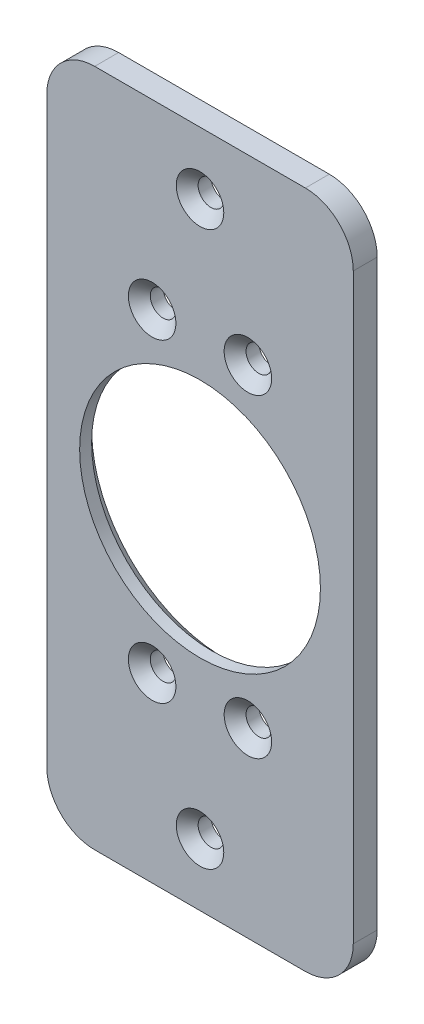
ISO-10303-21;
HEADER;
FILE_DESCRIPTION(('STEP AP214'),'2;1');
FILE_NAME('part.step','',(''),(''),'','','');
FILE_SCHEMA(('AUTOMOTIVE_DESIGN { 1 0 10303 214 1 1 1 1 }'));
ENDSEC;
DATA;
#1=APPLICATION_CONTEXT('core data for automotive mechanical design processes');
#2=APPLICATION_PROTOCOL_DEFINITION('international standard','automotive_design',2000,#1);
#3=PRODUCT_CONTEXT('',#1,'mechanical');
#4=PRODUCT('Part','Part','',(#3));
#5=PRODUCT_RELATED_PRODUCT_CATEGORY('part','',(#4));
#6=PRODUCT_DEFINITION_FORMATION('','',#4);
#7=PRODUCT_DEFINITION_CONTEXT('part definition',#1,'design');
#8=PRODUCT_DEFINITION('design','',#6,#7);
#9=PRODUCT_DEFINITION_SHAPE('','',#8);
#10=(LENGTH_UNIT() NAMED_UNIT(*) SI_UNIT(.MILLI.,.METRE.));
#11=(NAMED_UNIT(*) PLANE_ANGLE_UNIT() SI_UNIT($,.RADIAN.));
#12=(NAMED_UNIT(*) SI_UNIT($,.STERADIAN.) SOLID_ANGLE_UNIT());
#13=UNCERTAINTY_MEASURE_WITH_UNIT(LENGTH_MEASURE(1.E-05),#10,'distance_accuracy_value','');
#14=(GEOMETRIC_REPRESENTATION_CONTEXT(3) GLOBAL_UNCERTAINTY_ASSIGNED_CONTEXT((#13)) GLOBAL_UNIT_ASSIGNED_CONTEXT((#10,
#11,#12)) REPRESENTATION_CONTEXT('',''));
#15=CARTESIAN_POINT('',(0.,0.,0.));
#16=DIRECTION('',(0.,0.,1.));
#17=DIRECTION('',(1.,0.,0.));
#18=AXIS2_PLACEMENT_3D('',#15,#16,#17);
#19=CARTESIAN_POINT('',(0.,-5.71358770418942E-12,197.764400000001));
#20=DIRECTION('',(0.,0.,1.));
#21=DIRECTION('',(1.,0.,0.));
#22=AXIS2_PLACEMENT_3D('',#19,#20,#21);
#23=PLANE('',#22);
#24=CARTESIAN_POINT('',(0.,-5.71358770418942E-12,197.764400000001));
#25=DIRECTION('',(0.,0.,-1.));
#26=DIRECTION('',(0.,1.,0.));
#27=AXIS2_PLACEMENT_3D('',#24,#25,#26);
#28=CIRCLE('',#27,17.5514);
#29=CARTESIAN_POINT('',(0.,17.5513999999943,197.764400000001));
#30=VERTEX_POINT('',#29);
#31=EDGE_CURVE('E109',#30,#30,#28,.F.);
#32=ORIENTED_EDGE('',*,*,#31,.T.);
#33=EDGE_LOOP('',(#32));
#34=FACE_BOUND('',#33,.T.);
#35=CARTESIAN_POINT('',(0.,36.7324999999902,197.764400000001));
#36=DIRECTION('',(0.,0.,-1.));
#37=DIRECTION('',(-1.,0.,0.));
#38=AXIS2_PLACEMENT_3D('',#35,#36,#37);
#39=CIRCLE('',#38,1.7);
#40=CARTESIAN_POINT('',(-1.70000000000001,36.7324999999902,197.764400000001));
#41=VERTEX_POINT('',#40);
#42=EDGE_CURVE('E202',#41,#41,#39,.F.);
#43=ORIENTED_EDGE('',*,*,#42,.T.);
#44=EDGE_LOOP('',(#43));
#45=FACE_BOUND('',#44,.T.);
#46=CARTESIAN_POINT('',(6.35,20.8574999999903,197.764400000001));
#47=DIRECTION('',(0.,0.,-1.));
#48=DIRECTION('',(-1.,0.,0.));
#49=AXIS2_PLACEMENT_3D('',#46,#47,#48);
#50=CIRCLE('',#49,1.7);
#51=CARTESIAN_POINT('',(4.65,20.8574999999903,197.764400000001));
#52=VERTEX_POINT('',#51);
#53=EDGE_CURVE('E206',#52,#52,#50,.F.);
#54=ORIENTED_EDGE('',*,*,#53,.T.);
#55=EDGE_LOOP('',(#54));
#56=FACE_BOUND('',#55,.T.);
#57=CARTESIAN_POINT('',(6.35,-20.8575000000017,197.764400000001));
#58=DIRECTION('',(0.,0.,-1.));
#59=DIRECTION('',(-1.,0.,0.));
#60=AXIS2_PLACEMENT_3D('',#57,#58,#59);
#61=CIRCLE('',#60,1.7);
#62=CARTESIAN_POINT('',(4.65,-20.8575000000017,197.764400000001));
#63=VERTEX_POINT('',#62);
#64=EDGE_CURVE('E210',#63,#63,#61,.F.);
#65=ORIENTED_EDGE('',*,*,#64,.T.);
#66=EDGE_LOOP('',(#65));
#67=FACE_BOUND('',#66,.T.);
#68=CARTESIAN_POINT('',(-6.34999999999997,-20.8575000000017,197.764400000001));
#69=DIRECTION('',(0.,0.,-1.));
#70=DIRECTION('',(-1.,0.,0.));
#71=AXIS2_PLACEMENT_3D('',#68,#69,#70);
#72=CIRCLE('',#71,1.7);
#73=CARTESIAN_POINT('',(-8.04999999999997,-20.8575000000017,197.764400000001));
#74=VERTEX_POINT('',#73);
#75=EDGE_CURVE('E214',#74,#74,#72,.F.);
#76=ORIENTED_EDGE('',*,*,#75,.T.);
#77=EDGE_LOOP('',(#76));
#78=FACE_BOUND('',#77,.T.);
#79=CARTESIAN_POINT('',(0.,-36.7325000000017,197.764400000001));
#80=DIRECTION('',(0.,0.,-1.));
#81=DIRECTION('',(-1.,0.,0.));
#82=AXIS2_PLACEMENT_3D('',#79,#80,#81);
#83=CIRCLE('',#82,1.7);
#84=CARTESIAN_POINT('',(-1.69999999999998,-36.7325000000017,197.764400000001));
#85=VERTEX_POINT('',#84);
#86=EDGE_CURVE('E217',#85,#85,#83,.F.);
#87=ORIENTED_EDGE('',*,*,#86,.T.);
#88=EDGE_LOOP('',(#87));
#89=FACE_BOUND('',#88,.T.);
#90=CARTESIAN_POINT('',(-6.35,20.8574999999903,197.764400000001));
#91=DIRECTION('',(0.,0.,-1.));
#92=DIRECTION('',(-1.,0.,0.));
#93=AXIS2_PLACEMENT_3D('',#90,#91,#92);
#94=CIRCLE('',#93,1.7);
#95=CARTESIAN_POINT('',(-8.05,20.8574999999903,197.764400000001));
#96=VERTEX_POINT('',#95);
#97=EDGE_CURVE('E20',#96,#96,#94,.F.);
#98=ORIENTED_EDGE('',*,*,#97,.T.);
#99=EDGE_LOOP('',(#98));
#100=FACE_BOUND('',#99,.T.);
#101=DIRECTION('',(1.,0.,0.));
#102=VECTOR('',#101,1.);
#103=CARTESIAN_POINT('',(20.32,44.9874999999902,197.764400000001));
#104=LINE('',#103,#102);
#105=CARTESIAN_POINT('',(13.97,44.9874999999902,197.764400000001));
#106=VERTEX_POINT('',#105);
#107=CARTESIAN_POINT('',(-13.97,44.9874999999902,197.764400000001));
#108=VERTEX_POINT('',#107);
#109=EDGE_CURVE('E102',#106,#108,#104,.F.);
#110=ORIENTED_EDGE('',*,*,#109,.F.);
#111=CARTESIAN_POINT('',(13.97,38.6374999999902,197.764400000001));
#112=DIRECTION('',(0.,0.,1.));
#113=DIRECTION('',(1.,0.,0.));
#114=AXIS2_PLACEMENT_3D('',#111,#112,#113);
#115=CIRCLE('',#114,6.35);
#116=CARTESIAN_POINT('',(20.32,38.6374999999902,197.764400000001));
#117=VERTEX_POINT('',#116);
#118=EDGE_CURVE('E119',#117,#106,#115,.T.);
#119=ORIENTED_EDGE('',*,*,#118,.F.);
#120=DIRECTION('',(0.,1.,0.));
#121=VECTOR('',#120,1.);
#122=CARTESIAN_POINT('',(20.32,-44.9875000000017,197.764400000001));
#123=LINE('',#122,#121);
#124=CARTESIAN_POINT('',(20.32,-38.6375000000017,197.764400000001));
#125=VERTEX_POINT('',#124);
#126=EDGE_CURVE('E137',#125,#117,#123,.T.);
#127=ORIENTED_EDGE('',*,*,#126,.F.);
#128=CARTESIAN_POINT('',(13.97,-38.6375000000017,197.764400000001));
#129=DIRECTION('',(0.,0.,1.));
#130=DIRECTION('',(1.,0.,0.));
#131=AXIS2_PLACEMENT_3D('',#128,#129,#130);
#132=CIRCLE('',#131,6.35);
#133=CARTESIAN_POINT('',(13.97,-44.9875000000017,197.764400000001));
#134=VERTEX_POINT('',#133);
#135=EDGE_CURVE('E193',#134,#125,#132,.T.);
#136=ORIENTED_EDGE('',*,*,#135,.F.);
#137=DIRECTION('',(1.,0.,0.));
#138=VECTOR('',#137,1.);
#139=CARTESIAN_POINT('',(-20.32,-44.9875000000017,197.764400000001));
#140=LINE('',#139,#138);
#141=CARTESIAN_POINT('',(-13.97,-44.9875000000017,197.764400000001));
#142=VERTEX_POINT('',#141);
#143=EDGE_CURVE('E142',#142,#134,#140,.T.);
#144=ORIENTED_EDGE('',*,*,#143,.F.);
#145=CARTESIAN_POINT('',(-13.97,-38.6375000000017,197.764400000001));
#146=DIRECTION('',(0.,0.,1.));
#147=DIRECTION('',(1.,0.,0.));
#148=AXIS2_PLACEMENT_3D('',#145,#146,#147);
#149=CIRCLE('',#148,6.35);
#150=CARTESIAN_POINT('',(-20.32,-38.6375000000017,197.764400000001));
#151=VERTEX_POINT('',#150);
#152=EDGE_CURVE('E196',#151,#142,#149,.T.);
#153=ORIENTED_EDGE('',*,*,#152,.F.);
#154=DIRECTION('',(0.,1.,0.));
#155=VECTOR('',#154,1.);
#156=CARTESIAN_POINT('',(-20.32,44.9874999999902,197.764400000001));
#157=LINE('',#156,#155);
#158=CARTESIAN_POINT('',(-20.32,38.6374999999902,197.764400000001));
#159=VERTEX_POINT('',#158);
#160=EDGE_CURVE('E104',#159,#151,#157,.F.);
#161=ORIENTED_EDGE('',*,*,#160,.F.);
#162=CARTESIAN_POINT('',(-13.97,38.6374999999902,197.764400000001));
#163=DIRECTION('',(0.,0.,1.));
#164=DIRECTION('',(1.,0.,0.));
#165=AXIS2_PLACEMENT_3D('',#162,#163,#164);
#166=CIRCLE('',#165,6.35);
#167=EDGE_CURVE('E98',#108,#159,#166,.T.);
#168=ORIENTED_EDGE('',*,*,#167,.F.);
#169=EDGE_LOOP('',(#110,#119,#127,#136,#144,#153,#161,#168));
#170=FACE_BOUND('',#169,.T.);
#171=ADVANCED_FACE('F17',(#34,#45,#56,#67,#78,#89,#100,#170),#23,.F.);
#172=CARTESIAN_POINT('',(-6.35,20.8574999999903,193.439400000001));
#173=DIRECTION('',(0.,0.,-1.));
#174=DIRECTION('',(-1.,0.,0.));
#175=AXIS2_PLACEMENT_3D('',#172,#173,#174);
#176=CYLINDRICAL_SURFACE('',#175,1.7);
#177=ORIENTED_EDGE('',*,*,#97,.F.);
#178=EDGE_LOOP('',(#177));
#179=FACE_BOUND('',#178,.T.);
#180=CARTESIAN_POINT('',(-6.35,20.8574999999903,199.489399999948));
#181=DIRECTION('',(0.,0.,1.));
#182=DIRECTION('',(1.,0.,0.));
#183=AXIS2_PLACEMENT_3D('',#180,#181,#182);
#184=CIRCLE('',#183,1.69999999997353);
#185=CARTESIAN_POINT('',(-4.65000000002647,20.8574999999903,199.489399999948));
#186=VERTEX_POINT('',#185);
#187=EDGE_CURVE('E123',#186,#186,#184,.T.);
#188=ORIENTED_EDGE('',*,*,#187,.T.);
#189=EDGE_LOOP('',(#188));
#190=FACE_BOUND('',#189,.T.);
#191=ADVANCED_FACE('F229',(#179,#190),#176,.F.);
#192=CARTESIAN_POINT('',(0.,-36.7325000000017,193.439400000001));
#193=DIRECTION('',(0.,0.,-1.));
#194=DIRECTION('',(-1.,0.,0.));
#195=AXIS2_PLACEMENT_3D('',#192,#193,#194);
#196=CYLINDRICAL_SURFACE('',#195,1.7);
#197=ORIENTED_EDGE('',*,*,#86,.F.);
#198=EDGE_LOOP('',(#197));
#199=FACE_BOUND('',#198,.T.);
#200=CARTESIAN_POINT('',(0.,-36.7325000000017,199.489400000004));
#201=DIRECTION('',(0.,0.,1.));
#202=DIRECTION('',(1.,0.,0.));
#203=AXIS2_PLACEMENT_3D('',#200,#201,#202);
#204=CIRCLE('',#203,1.70000000008484);
#205=CARTESIAN_POINT('',(1.70000000008486,-36.7325000000017,199.489400000004));
#206=VERTEX_POINT('',#205);
#207=EDGE_CURVE('E130',#206,#206,#204,.T.);
#208=ORIENTED_EDGE('',*,*,#207,.T.);
#209=EDGE_LOOP('',(#208));
#210=FACE_BOUND('',#209,.T.);
#211=ADVANCED_FACE('F232',(#199,#210),#196,.F.);
#212=CARTESIAN_POINT('',(-6.34999999999997,-20.8575000000017,193.439400000001));
#213=DIRECTION('',(0.,0.,-1.));
#214=DIRECTION('',(-1.,0.,0.));
#215=AXIS2_PLACEMENT_3D('',#212,#213,#214);
#216=CYLINDRICAL_SURFACE('',#215,1.7);
#217=ORIENTED_EDGE('',*,*,#75,.F.);
#218=EDGE_LOOP('',(#217));
#219=FACE_BOUND('',#218,.T.);
#220=CARTESIAN_POINT('',(-6.34999999999997,-20.8575000000017,199.489399999948));
#221=DIRECTION('',(0.,0.,1.));
#222=DIRECTION('',(1.,0.,0.));
#223=AXIS2_PLACEMENT_3D('',#220,#221,#222);
#224=CIRCLE('',#223,1.69999999997351);
#225=CARTESIAN_POINT('',(-4.65000000002647,-20.8575000000017,199.489399999948));
#226=VERTEX_POINT('',#225);
#227=EDGE_CURVE('E286',#226,#226,#224,.T.);
#228=ORIENTED_EDGE('',*,*,#227,.T.);
#229=EDGE_LOOP('',(#228));
#230=FACE_BOUND('',#229,.T.);
#231=ADVANCED_FACE('F355',(#219,#230),#216,.F.);
#232=CARTESIAN_POINT('',(6.35,-20.8575000000017,193.439400000001));
#233=DIRECTION('',(0.,0.,-1.));
#234=DIRECTION('',(-1.,0.,0.));
#235=AXIS2_PLACEMENT_3D('',#232,#233,#234);
#236=CYLINDRICAL_SURFACE('',#235,1.7);
#237=ORIENTED_EDGE('',*,*,#64,.F.);
#238=EDGE_LOOP('',(#237));
#239=FACE_BOUND('',#238,.T.);
#240=CARTESIAN_POINT('',(6.35,-20.8575000000017,199.489400000004));
#241=DIRECTION('',(0.,0.,1.));
#242=DIRECTION('',(1.,0.,0.));
#243=AXIS2_PLACEMENT_3D('',#240,#241,#242);
#244=CIRCLE('',#243,1.70000000008249);
#245=CARTESIAN_POINT('',(8.05000000008249,-20.8575000000017,199.489400000004));
#246=VERTEX_POINT('',#245);
#247=EDGE_CURVE('E280',#246,#246,#244,.T.);
#248=ORIENTED_EDGE('',*,*,#247,.T.);
#249=EDGE_LOOP('',(#248));
#250=FACE_BOUND('',#249,.T.);
#251=ADVANCED_FACE('F351',(#239,#250),#236,.F.);
#252=CARTESIAN_POINT('',(6.35,20.8574999999903,193.439400000001));
#253=DIRECTION('',(0.,0.,-1.));
#254=DIRECTION('',(-1.,0.,0.));
#255=AXIS2_PLACEMENT_3D('',#252,#253,#254);
#256=CYLINDRICAL_SURFACE('',#255,1.7);
#257=ORIENTED_EDGE('',*,*,#53,.F.);
#258=EDGE_LOOP('',(#257));
#259=FACE_BOUND('',#258,.T.);
#260=CARTESIAN_POINT('',(6.35,20.8574999999903,199.489400000004));
#261=DIRECTION('',(0.,0.,1.));
#262=DIRECTION('',(1.,0.,0.));
#263=AXIS2_PLACEMENT_3D('',#260,#261,#262);
#264=CIRCLE('',#263,1.70000000008249);
#265=CARTESIAN_POINT('',(8.05000000008249,20.8574999999903,199.489400000004));
#266=VERTEX_POINT('',#265);
#267=EDGE_CURVE('E274',#266,#266,#264,.T.);
#268=ORIENTED_EDGE('',*,*,#267,.T.);
#269=EDGE_LOOP('',(#268));
#270=FACE_BOUND('',#269,.T.);
#271=ADVANCED_FACE('F347',(#259,#270),#256,.F.);
#272=CARTESIAN_POINT('',(0.,36.7324999999902,193.439400000001));
#273=DIRECTION('',(0.,0.,-1.));
#274=DIRECTION('',(-1.,0.,0.));
#275=AXIS2_PLACEMENT_3D('',#272,#273,#274);
#276=CYLINDRICAL_SURFACE('',#275,1.7);
#277=ORIENTED_EDGE('',*,*,#42,.F.);
#278=EDGE_LOOP('',(#277));
#279=FACE_BOUND('',#278,.T.);
#280=CARTESIAN_POINT('',(0.,36.7324999999902,199.489400000004));
#281=DIRECTION('',(0.,0.,1.));
#282=DIRECTION('',(1.,0.,0.));
#283=AXIS2_PLACEMENT_3D('',#280,#281,#282);
#284=CIRCLE('',#283,1.70000000008486);
#285=CARTESIAN_POINT('',(1.70000000008486,36.7324999999902,199.489400000004));
#286=VERTEX_POINT('',#285);
#287=EDGE_CURVE('E270',#286,#286,#284,.T.);
#288=ORIENTED_EDGE('',*,*,#287,.T.);
#289=EDGE_LOOP('',(#288));
#290=FACE_BOUND('',#289,.T.);
#291=ADVANCED_FACE('F343',(#279,#290),#276,.F.);
#292=CARTESIAN_POINT('',(0.,-5.71358770418942E-12,197.764400000001));
#293=DIRECTION('',(0.,0.,-1.));
#294=DIRECTION('',(0.,1.,0.));
#295=AXIS2_PLACEMENT_3D('',#292,#293,#294);
#296=CONICAL_SURFACE('',#295,17.5514,0.785398163397444);
#297=ORIENTED_EDGE('',*,*,#31,.F.);
#298=EDGE_LOOP('',(#297));
#299=FACE_BOUND('',#298,.T.);
#300=CARTESIAN_POINT('',(0.,-5.71358770418942E-12,199.351900000001));
#301=DIRECTION('',(0.,0.,1.));
#302=DIRECTION('',(1.,0.,0.));
#303=AXIS2_PLACEMENT_3D('',#300,#301,#302);
#304=CIRCLE('',#303,15.9639);
#305=CARTESIAN_POINT('',(15.9639,-5.71358770418942E-12,199.351900000001));
#306=VERTEX_POINT('',#305);
#307=EDGE_CURVE('E190',#306,#306,#304,.T.);
#308=ORIENTED_EDGE('',*,*,#307,.T.);
#309=EDGE_LOOP('',(#308));
#310=FACE_BOUND('',#309,.T.);
#311=ADVANCED_FACE('F340',(#299,#310),#296,.F.);
#312=CARTESIAN_POINT('',(-13.97,38.6374999999902,197.764400000001));
#313=DIRECTION('',(0.,0.,1.));
#314=DIRECTION('',(1.,0.,0.));
#315=AXIS2_PLACEMENT_3D('',#312,#313,#314);
#316=CYLINDRICAL_SURFACE('',#315,6.35);
#317=ORIENTED_EDGE('',*,*,#167,.T.);
#318=DIRECTION('',(0.,0.,1.));
#319=VECTOR('',#318,1.);
#320=CARTESIAN_POINT('',(-20.32,38.6374999999902,197.764400000001));
#321=LINE('',#320,#319);
#322=CARTESIAN_POINT('',(-20.32,38.6374999999902,200.939400000001));
#323=VERTEX_POINT('',#322);
#324=EDGE_CURVE('E108',#323,#159,#321,.F.);
#325=ORIENTED_EDGE('',*,*,#324,.F.);
#326=CARTESIAN_POINT('',(-13.97,38.6374999999902,200.939400000001));
#327=DIRECTION('',(0.,0.,1.));
#328=DIRECTION('',(1.,0.,0.));
#329=AXIS2_PLACEMENT_3D('',#326,#327,#328);
#330=CIRCLE('',#329,6.35);
#331=CARTESIAN_POINT('',(-13.97,44.9874999999902,200.939400000001));
#332=VERTEX_POINT('',#331);
#333=EDGE_CURVE('E115',#332,#323,#330,.T.);
#334=ORIENTED_EDGE('',*,*,#333,.F.);
#335=DIRECTION('',(0.,0.,1.));
#336=VECTOR('',#335,1.);
#337=CARTESIAN_POINT('',(-13.97,44.9874999999902,197.764400000001));
#338=LINE('',#337,#336);
#339=EDGE_CURVE('E112',#108,#332,#338,.T.);
#340=ORIENTED_EDGE('',*,*,#339,.F.);
#341=EDGE_LOOP('',(#317,#325,#334,#340));
#342=FACE_BOUND('',#341,.T.);
#343=ADVANCED_FACE('F113',(#342),#316,.T.);
#344=CARTESIAN_POINT('',(-20.32,44.9874999999902,197.764400000001));
#345=DIRECTION('',(-1.,0.,0.));
#346=DIRECTION('',(0.,0.,1.));
#347=AXIS2_PLACEMENT_3D('',#344,#345,#346);
#348=PLANE('',#347);
#349=DIRECTION('',(0.,0.,1.));
#350=VECTOR('',#349,1.);
#351=CARTESIAN_POINT('',(-20.32,-38.6375000000017,197.764400000001));
#352=LINE('',#351,#350);
#353=CARTESIAN_POINT('',(-20.32,-38.6375000000017,200.939400000001));
#354=VERTEX_POINT('',#353);
#355=EDGE_CURVE('E148',#354,#151,#352,.F.);
#356=ORIENTED_EDGE('',*,*,#355,.F.);
#357=DIRECTION('',(0.,1.,0.));
#358=VECTOR('',#357,1.);
#359=CARTESIAN_POINT('',(-20.32,-5.71358770418942E-12,200.939400000001));
#360=LINE('',#359,#358);
#361=EDGE_CURVE('E188',#323,#354,#360,.F.);
#362=ORIENTED_EDGE('',*,*,#361,.F.);
#363=ORIENTED_EDGE('',*,*,#324,.T.);
#364=ORIENTED_EDGE('',*,*,#160,.T.);
#365=EDGE_LOOP('',(#356,#362,#363,#364));
#366=FACE_BOUND('',#365,.T.);
#367=ADVANCED_FACE('F333',(#366),#348,.T.);
#368=CARTESIAN_POINT('',(-13.97,-38.6375000000017,197.764400000001));
#369=DIRECTION('',(0.,0.,1.));
#370=DIRECTION('',(1.,0.,0.));
#371=AXIS2_PLACEMENT_3D('',#368,#369,#370);
#372=CYLINDRICAL_SURFACE('',#371,6.35);
#373=ORIENTED_EDGE('',*,*,#152,.T.);
#374=DIRECTION('',(0.,0.,-1.));
#375=VECTOR('',#374,1.);
#376=CARTESIAN_POINT('',(-13.97,-44.9875000000017,197.764400000001));
#377=LINE('',#376,#375);
#378=CARTESIAN_POINT('',(-13.97,-44.9875000000017,200.939400000001));
#379=VERTEX_POINT('',#378);
#380=EDGE_CURVE('E146',#379,#142,#377,.T.);
#381=ORIENTED_EDGE('',*,*,#380,.F.);
#382=CARTESIAN_POINT('',(-13.97,-38.6375000000017,200.939400000001));
#383=DIRECTION('',(0.,0.,1.));
#384=DIRECTION('',(1.,0.,0.));
#385=AXIS2_PLACEMENT_3D('',#382,#383,#384);
#386=CIRCLE('',#385,6.35);
#387=EDGE_CURVE('E184',#354,#379,#386,.T.);
#388=ORIENTED_EDGE('',*,*,#387,.F.);
#389=ORIENTED_EDGE('',*,*,#355,.T.);
#390=EDGE_LOOP('',(#373,#381,#388,#389));
#391=FACE_BOUND('',#390,.T.);
#392=ADVANCED_FACE('F329',(#391),#372,.T.);
#393=CARTESIAN_POINT('',(-20.32,-44.9875000000017,197.764400000001));
#394=DIRECTION('',(0.,-1.,0.));
#395=DIRECTION('',(0.,0.,-1.));
#396=AXIS2_PLACEMENT_3D('',#393,#394,#395);
#397=PLANE('',#396);
#398=DIRECTION('',(0.,0.,1.));
#399=VECTOR('',#398,1.);
#400=CARTESIAN_POINT('',(13.97,-44.9875000000017,197.764400000001));
#401=LINE('',#400,#399);
#402=CARTESIAN_POINT('',(13.97,-44.9875000000017,200.939400000001));
#403=VERTEX_POINT('',#402);
#404=EDGE_CURVE('E145',#403,#134,#401,.F.);
#405=ORIENTED_EDGE('',*,*,#404,.F.);
#406=DIRECTION('',(1.,0.,0.));
#407=VECTOR('',#406,1.);
#408=CARTESIAN_POINT('',(0.,-44.9875000000017,200.939400000001));
#409=LINE('',#408,#407);
#410=EDGE_CURVE('E183',#379,#403,#409,.T.);
#411=ORIENTED_EDGE('',*,*,#410,.F.);
#412=ORIENTED_EDGE('',*,*,#380,.T.);
#413=ORIENTED_EDGE('',*,*,#143,.T.);
#414=EDGE_LOOP('',(#405,#411,#412,#413));
#415=FACE_BOUND('',#414,.T.);
#416=ADVANCED_FACE('F325',(#415),#397,.T.);
#417=CARTESIAN_POINT('',(13.97,-38.6375000000017,197.764400000001));
#418=DIRECTION('',(0.,0.,1.));
#419=DIRECTION('',(1.,0.,0.));
#420=AXIS2_PLACEMENT_3D('',#417,#418,#419);
#421=CYLINDRICAL_SURFACE('',#420,6.35);
#422=ORIENTED_EDGE('',*,*,#135,.T.);
#423=DIRECTION('',(0.,0.,-1.));
#424=VECTOR('',#423,1.);
#425=CARTESIAN_POINT('',(20.32,-38.6375000000017,197.764400000001));
#426=LINE('',#425,#424);
#427=CARTESIAN_POINT('',(20.32,-38.6375000000017,200.939400000001));
#428=VERTEX_POINT('',#427);
#429=EDGE_CURVE('E141',#428,#125,#426,.T.);
#430=ORIENTED_EDGE('',*,*,#429,.F.);
#431=CARTESIAN_POINT('',(13.97,-38.6375000000017,200.939400000001));
#432=DIRECTION('',(0.,0.,1.));
#433=DIRECTION('',(1.,0.,0.));
#434=AXIS2_PLACEMENT_3D('',#431,#432,#433);
#435=CIRCLE('',#434,6.35);
#436=EDGE_CURVE('E179',#403,#428,#435,.T.);
#437=ORIENTED_EDGE('',*,*,#436,.F.);
#438=ORIENTED_EDGE('',*,*,#404,.T.);
#439=EDGE_LOOP('',(#422,#430,#437,#438));
#440=FACE_BOUND('',#439,.T.);
#441=ADVANCED_FACE('F322',(#440),#421,.T.);
#442=CARTESIAN_POINT('',(20.32,-44.9875000000017,197.764400000001));
#443=DIRECTION('',(1.,0.,0.));
#444=DIRECTION('',(0.,0.,-1.));
#445=AXIS2_PLACEMENT_3D('',#442,#443,#444);
#446=PLANE('',#445);
#447=ORIENTED_EDGE('',*,*,#429,.T.);
#448=ORIENTED_EDGE('',*,*,#126,.T.);
#449=DIRECTION('',(0.,0.,1.));
#450=VECTOR('',#449,1.);
#451=CARTESIAN_POINT('',(20.32,38.6374999999902,197.764400000001));
#452=LINE('',#451,#450);
#453=CARTESIAN_POINT('',(20.32,38.6374999999902,200.939400000001));
#454=VERTEX_POINT('',#453);
#455=EDGE_CURVE('E140',#454,#117,#452,.F.);
#456=ORIENTED_EDGE('',*,*,#455,.F.);
#457=DIRECTION('',(0.,1.,0.));
#458=VECTOR('',#457,1.);
#459=CARTESIAN_POINT('',(20.32,-5.71358770418942E-12,200.939400000001));
#460=LINE('',#459,#458);
#461=EDGE_CURVE('E178',#428,#454,#460,.T.);
#462=ORIENTED_EDGE('',*,*,#461,.F.);
#463=EDGE_LOOP('',(#447,#448,#456,#462));
#464=FACE_BOUND('',#463,.T.);
#465=ADVANCED_FACE('F319',(#464),#446,.T.);
#466=CARTESIAN_POINT('',(13.97,38.6374999999902,197.764400000001));
#467=DIRECTION('',(0.,0.,1.));
#468=DIRECTION('',(1.,0.,0.));
#469=AXIS2_PLACEMENT_3D('',#466,#467,#468);
#470=CYLINDRICAL_SURFACE('',#469,6.35);
#471=ORIENTED_EDGE('',*,*,#118,.T.);
#472=DIRECTION('',(0.,0.,1.));
#473=VECTOR('',#472,1.);
#474=CARTESIAN_POINT('',(13.97,44.9874999999902,197.764400000001));
#475=LINE('',#474,#473);
#476=CARTESIAN_POINT('',(13.97,44.9874999999902,200.939400000001));
#477=VERTEX_POINT('',#476);
#478=EDGE_CURVE('E40',#477,#106,#475,.F.);
#479=ORIENTED_EDGE('',*,*,#478,.F.);
#480=CARTESIAN_POINT('',(13.97,38.6374999999902,200.939400000001));
#481=DIRECTION('',(0.,0.,1.));
#482=DIRECTION('',(1.,0.,0.));
#483=AXIS2_PLACEMENT_3D('',#480,#481,#482);
#484=CIRCLE('',#483,6.35);
#485=EDGE_CURVE('E174',#454,#477,#484,.T.);
#486=ORIENTED_EDGE('',*,*,#485,.F.);
#487=ORIENTED_EDGE('',*,*,#455,.T.);
#488=EDGE_LOOP('',(#471,#479,#486,#487));
#489=FACE_BOUND('',#488,.T.);
#490=ADVANCED_FACE('F251',(#489),#470,.T.);
#491=CARTESIAN_POINT('',(20.32,44.9874999999902,197.764400000001));
#492=DIRECTION('',(0.,1.,0.));
#493=DIRECTION('',(0.,0.,1.));
#494=AXIS2_PLACEMENT_3D('',#491,#492,#493);
#495=PLANE('',#494);
#496=ORIENTED_EDGE('',*,*,#478,.T.);
#497=ORIENTED_EDGE('',*,*,#109,.T.);
#498=ORIENTED_EDGE('',*,*,#339,.T.);
#499=DIRECTION('',(1.,0.,0.));
#500=VECTOR('',#499,1.);
#501=CARTESIAN_POINT('',(0.,44.9874999999902,200.939400000001));
#502=LINE('',#501,#500);
#503=EDGE_CURVE('E173',#477,#332,#502,.F.);
#504=ORIENTED_EDGE('',*,*,#503,.F.);
#505=EDGE_LOOP('',(#496,#497,#498,#504));
#506=FACE_BOUND('',#505,.T.);
#507=ADVANCED_FACE('F121',(#506),#495,.T.);
#508=CARTESIAN_POINT('',(-6.35,20.8574999999903,200.939399999925));
#509=DIRECTION('',(0.,0.,1.));
#510=DIRECTION('',(1.,0.,0.));
#511=AXIS2_PLACEMENT_3D('',#508,#509,#510);
#512=CONICAL_SURFACE('',#511,3.14999999995061,0.785398163377847);
#513=ORIENTED_EDGE('',*,*,#187,.F.);
#514=EDGE_LOOP('',(#513));
#515=FACE_BOUND('',#514,.T.);
#516=CARTESIAN_POINT('',(-6.35,20.8574999999903,200.939399999982));
#517=DIRECTION('',(0.,0.,1.));
#518=DIRECTION('',(1.,0.,0.));
#519=AXIS2_PLACEMENT_3D('',#516,#517,#518);
#520=CIRCLE('',#519,3.15000000000746);
#521=CARTESIAN_POINT('',(-3.19999999999254,20.8574999999903,200.939399999982));
#522=VERTEX_POINT('',#521);
#523=EDGE_CURVE('E169',#522,#522,#520,.F.);
#524=ORIENTED_EDGE('',*,*,#523,.F.);
#525=EDGE_LOOP('',(#524));
#526=FACE_BOUND('',#525,.T.);
#527=ADVANCED_FACE('F235',(#515,#526),#512,.F.);
#528=CARTESIAN_POINT('',(0.,-36.7325000000017,200.939399999925));
#529=DIRECTION('',(0.,0.,1.));
#530=DIRECTION('',(1.,0.,0.));
#531=AXIS2_PLACEMENT_3D('',#528,#529,#530);
#532=CONICAL_SURFACE('',#531,3.14999999994823,0.785398163397448);
#533=ORIENTED_EDGE('',*,*,#207,.F.);
#534=EDGE_LOOP('',(#533));
#535=FACE_BOUND('',#534,.T.);
#536=CARTESIAN_POINT('',(0.,-36.7325000000017,200.939400000038));
#537=DIRECTION('',(0.,0.,1.));
#538=DIRECTION('',(1.,0.,0.));
#539=AXIS2_PLACEMENT_3D('',#536,#537,#538);
#540=CIRCLE('',#539,3.15000000006192);
#541=CARTESIAN_POINT('',(3.15000000006194,-36.7325000000017,200.939400000038));
#542=VERTEX_POINT('',#541);
#543=EDGE_CURVE('E165',#542,#542,#540,.F.);
#544=ORIENTED_EDGE('',*,*,#543,.F.);
#545=EDGE_LOOP('',(#544));
#546=FACE_BOUND('',#545,.T.);
#547=ADVANCED_FACE('F238',(#535,#546),#532,.F.);
#548=CARTESIAN_POINT('',(-6.34999999999997,-20.8575000000017,200.939399999925));
#549=DIRECTION('',(0.,0.,1.));
#550=DIRECTION('',(1.,0.,0.));
#551=AXIS2_PLACEMENT_3D('',#548,#549,#550);
#552=CONICAL_SURFACE('',#551,3.14999999995059,0.785398163377847);
#553=ORIENTED_EDGE('',*,*,#227,.F.);
#554=EDGE_LOOP('',(#553));
#555=FACE_BOUND('',#554,.T.);
#556=CARTESIAN_POINT('',(-6.34999999999997,-20.8575000000017,200.939399999982));
#557=DIRECTION('',(0.,0.,1.));
#558=DIRECTION('',(1.,0.,0.));
#559=AXIS2_PLACEMENT_3D('',#556,#557,#558);
#560=CIRCLE('',#559,3.15000000000743);
#561=CARTESIAN_POINT('',(-3.19999999999254,-20.8575000000017,200.939399999982));
#562=VERTEX_POINT('',#561);
#563=EDGE_CURVE('E161',#562,#562,#560,.F.);
#564=ORIENTED_EDGE('',*,*,#563,.F.);
#565=EDGE_LOOP('',(#564));
#566=FACE_BOUND('',#565,.T.);
#567=ADVANCED_FACE('F302',(#555,#566),#552,.F.);
#568=CARTESIAN_POINT('',(6.35,-20.8575000000017,200.939399999925));
#569=DIRECTION('',(0.,0.,1.));
#570=DIRECTION('',(1.,0.,0.));
#571=AXIS2_PLACEMENT_3D('',#568,#569,#570);
#572=CONICAL_SURFACE('',#571,3.14999999994589,0.785398163397448);
#573=ORIENTED_EDGE('',*,*,#247,.F.);
#574=EDGE_LOOP('',(#573));
#575=FACE_BOUND('',#574,.T.);
#576=CARTESIAN_POINT('',(6.35,-20.8575000000017,200.939400000038));
#577=DIRECTION('',(0.,0.,1.));
#578=DIRECTION('',(1.,0.,0.));
#579=AXIS2_PLACEMENT_3D('',#576,#577,#578);
#580=CIRCLE('',#579,3.15000000005957);
#581=CARTESIAN_POINT('',(9.50000000005957,-20.8575000000017,200.939400000038));
#582=VERTEX_POINT('',#581);
#583=EDGE_CURVE('E157',#582,#582,#580,.F.);
#584=ORIENTED_EDGE('',*,*,#583,.F.);
#585=EDGE_LOOP('',(#584));
#586=FACE_BOUND('',#585,.T.);
#587=ADVANCED_FACE('F310',(#575,#586),#572,.F.);
#588=CARTESIAN_POINT('',(6.35,20.8574999999903,200.939399999925));
#589=DIRECTION('',(0.,0.,1.));
#590=DIRECTION('',(1.,0.,0.));
#591=AXIS2_PLACEMENT_3D('',#588,#589,#590);
#592=CONICAL_SURFACE('',#591,3.14999999994589,0.785398163397448);
#593=ORIENTED_EDGE('',*,*,#267,.F.);
#594=EDGE_LOOP('',(#593));
#595=FACE_BOUND('',#594,.T.);
#596=CARTESIAN_POINT('',(6.35,20.8574999999903,200.939400000038));
#597=DIRECTION('',(0.,0.,1.));
#598=DIRECTION('',(1.,0.,0.));
#599=AXIS2_PLACEMENT_3D('',#596,#597,#598);
#600=CIRCLE('',#599,3.15000000005957);
#601=CARTESIAN_POINT('',(9.50000000005957,20.8574999999903,200.939400000038));
#602=VERTEX_POINT('',#601);
#603=EDGE_CURVE('E153',#602,#602,#600,.F.);
#604=ORIENTED_EDGE('',*,*,#603,.F.);
#605=EDGE_LOOP('',(#604));
#606=FACE_BOUND('',#605,.T.);
#607=ADVANCED_FACE('F447',(#595,#606),#592,.F.);
#608=CARTESIAN_POINT('',(0.,36.7324999999902,200.939399999925));
#609=DIRECTION('',(0.,0.,1.));
#610=DIRECTION('',(1.,0.,0.));
#611=AXIS2_PLACEMENT_3D('',#608,#609,#610);
#612=CONICAL_SURFACE('',#611,3.14999999994826,0.785398163397448);
#613=ORIENTED_EDGE('',*,*,#287,.F.);
#614=EDGE_LOOP('',(#613));
#615=FACE_BOUND('',#614,.T.);
#616=CARTESIAN_POINT('',(0.,36.7324999999902,200.939400000038));
#617=DIRECTION('',(0.,0.,1.));
#618=DIRECTION('',(1.,0.,0.));
#619=AXIS2_PLACEMENT_3D('',#616,#617,#618);
#620=CIRCLE('',#619,3.15000000006194);
#621=CARTESIAN_POINT('',(3.15000000006194,36.7324999999902,200.939400000038));
#622=VERTEX_POINT('',#621);
#623=EDGE_CURVE('E27',#622,#622,#620,.F.);
#624=ORIENTED_EDGE('',*,*,#623,.F.);
#625=EDGE_LOOP('',(#624));
#626=FACE_BOUND('',#625,.T.);
#627=ADVANCED_FACE('F456',(#615,#626),#612,.F.);
#628=CARTESIAN_POINT('',(0.,-5.71358770418942E-12,197.764400000001));
#629=DIRECTION('',(0.,0.,1.));
#630=DIRECTION('',(1.,0.,0.));
#631=AXIS2_PLACEMENT_3D('',#628,#629,#630);
#632=CYLINDRICAL_SURFACE('',#631,15.9639);
#633=ORIENTED_EDGE('',*,*,#307,.F.);
#634=EDGE_LOOP('',(#633));
#635=FACE_BOUND('',#634,.T.);
#636=CARTESIAN_POINT('',(0.,-5.71358770418942E-12,200.939400000001));
#637=DIRECTION('',(0.,0.,1.));
#638=DIRECTION('',(1.,0.,0.));
#639=AXIS2_PLACEMENT_3D('',#636,#637,#638);
#640=CIRCLE('',#639,15.9639);
#641=CARTESIAN_POINT('',(15.9639,-5.71358770418942E-12,200.939400000001));
#642=VERTEX_POINT('',#641);
#643=EDGE_CURVE('E11',#642,#642,#640,.F.);
#644=ORIENTED_EDGE('',*,*,#643,.F.);
#645=EDGE_LOOP('',(#644));
#646=FACE_BOUND('',#645,.T.);
#647=ADVANCED_FACE('F245',(#635,#646),#632,.F.);
#648=CARTESIAN_POINT('',(0.,-5.71358770418942E-12,200.939400000001));
#649=DIRECTION('',(0.,0.,1.));
#650=DIRECTION('',(1.,0.,0.));
#651=AXIS2_PLACEMENT_3D('',#648,#649,#650);
#652=PLANE('',#651);
#653=ORIENTED_EDGE('',*,*,#643,.T.);
#654=EDGE_LOOP('',(#653));
#655=FACE_BOUND('',#654,.T.);
#656=ORIENTED_EDGE('',*,*,#623,.T.);
#657=EDGE_LOOP('',(#656));
#658=FACE_BOUND('',#657,.T.);
#659=ORIENTED_EDGE('',*,*,#603,.T.);
#660=EDGE_LOOP('',(#659));
#661=FACE_BOUND('',#660,.T.);
#662=ORIENTED_EDGE('',*,*,#583,.T.);
#663=EDGE_LOOP('',(#662));
#664=FACE_BOUND('',#663,.T.);
#665=ORIENTED_EDGE('',*,*,#563,.T.);
#666=EDGE_LOOP('',(#665));
#667=FACE_BOUND('',#666,.T.);
#668=ORIENTED_EDGE('',*,*,#543,.T.);
#669=EDGE_LOOP('',(#668));
#670=FACE_BOUND('',#669,.T.);
#671=ORIENTED_EDGE('',*,*,#523,.T.);
#672=EDGE_LOOP('',(#671));
#673=FACE_BOUND('',#672,.T.);
#674=ORIENTED_EDGE('',*,*,#485,.T.);
#675=ORIENTED_EDGE('',*,*,#503,.T.);
#676=ORIENTED_EDGE('',*,*,#333,.T.);
#677=ORIENTED_EDGE('',*,*,#361,.T.);
#678=ORIENTED_EDGE('',*,*,#387,.T.);
#679=ORIENTED_EDGE('',*,*,#410,.T.);
#680=ORIENTED_EDGE('',*,*,#436,.T.);
#681=ORIENTED_EDGE('',*,*,#461,.T.);
#682=EDGE_LOOP('',(#674,#675,#676,#677,#678,#679,#680,#681));
#683=FACE_BOUND('',#682,.T.);
#684=ADVANCED_FACE('F242',(#655,#658,#661,#664,#667,#670,#673,#683),#652,.T.);
#685=CLOSED_SHELL('',(#171,#191,#211,#231,#251,#271,#291,#311,#343,#367,#392,#416,#441,#465,
#490,#507,#527,#547,#567,#587,#607,#627,#647,#684));
#686=MANIFOLD_SOLID_BREP('B1',#685);
#687=ADVANCED_BREP_SHAPE_REPRESENTATION('',(#18,#686),#14);
#688=SHAPE_DEFINITION_REPRESENTATION(#9,#687);
ENDSEC;
END-ISO-10303-21;
